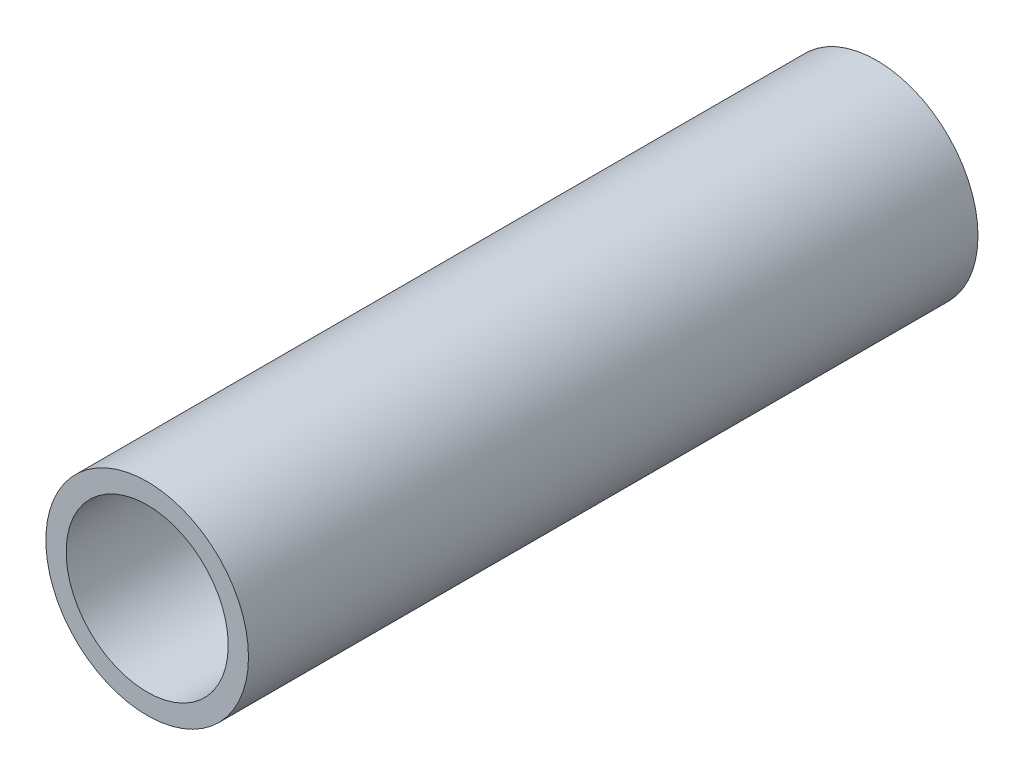
ISO-10303-21;
HEADER;
FILE_DESCRIPTION(('STEP AP214'),'2;1');
FILE_NAME('part.step','',(''),(''),'','','');
FILE_SCHEMA(('AUTOMOTIVE_DESIGN { 1 0 10303 214 1 1 1 1 }'));
ENDSEC;
DATA;
#1=APPLICATION_CONTEXT('core data for automotive mechanical design processes');
#2=APPLICATION_PROTOCOL_DEFINITION('international standard','automotive_design',2000,#1);
#3=PRODUCT_CONTEXT('',#1,'mechanical');
#4=PRODUCT('Part','Part','',(#3));
#5=PRODUCT_RELATED_PRODUCT_CATEGORY('part','',(#4));
#6=PRODUCT_DEFINITION_FORMATION('','',#4);
#7=PRODUCT_DEFINITION_CONTEXT('part definition',#1,'design');
#8=PRODUCT_DEFINITION('design','',#6,#7);
#9=PRODUCT_DEFINITION_SHAPE('','',#8);
#10=(LENGTH_UNIT() NAMED_UNIT(*) SI_UNIT(.MILLI.,.METRE.));
#11=(NAMED_UNIT(*) PLANE_ANGLE_UNIT() SI_UNIT($,.RADIAN.));
#12=(NAMED_UNIT(*) SI_UNIT($,.STERADIAN.) SOLID_ANGLE_UNIT());
#13=UNCERTAINTY_MEASURE_WITH_UNIT(LENGTH_MEASURE(1.E-05),#10,'distance_accuracy_value','');
#14=(GEOMETRIC_REPRESENTATION_CONTEXT(3) GLOBAL_UNCERTAINTY_ASSIGNED_CONTEXT((#13)) GLOBAL_UNIT_ASSIGNED_CONTEXT((#10,
#11,#12)) REPRESENTATION_CONTEXT('',''));
#15=CARTESIAN_POINT('',(0.,0.,0.));
#16=DIRECTION('',(0.,0.,1.));
#17=DIRECTION('',(1.,0.,0.));
#18=AXIS2_PLACEMENT_3D('',#15,#16,#17);
#19=CARTESIAN_POINT('',(0.,0.,9.));
#20=DIRECTION('',(0.,0.,1.));
#21=DIRECTION('',(1.,0.,0.));
#22=AXIS2_PLACEMENT_3D('',#19,#20,#21);
#23=PLANE('',#22);
#24=CARTESIAN_POINT('',(0.,0.,9.));
#25=DIRECTION('',(0.,0.,1.));
#26=DIRECTION('',(1.,0.,0.));
#27=AXIS2_PLACEMENT_3D('',#24,#25,#26);
#28=CIRCLE('',#27,1.25);
#29=CARTESIAN_POINT('',(1.25,0.,9.));
#30=VERTEX_POINT('',#29);
#31=EDGE_CURVE('E10',#30,#30,#28,.T.);
#32=ORIENTED_EDGE('',*,*,#31,.T.);
#33=EDGE_LOOP('',(#32));
#34=FACE_BOUND('',#33,.T.);
#35=CARTESIAN_POINT('',(0.,0.,9.));
#36=DIRECTION('',(0.,0.,1.));
#37=DIRECTION('',(1.,0.,0.));
#38=AXIS2_PLACEMENT_3D('',#35,#36,#37);
#39=CIRCLE('',#38,1.);
#40=CARTESIAN_POINT('',(1.,0.,9.));
#41=VERTEX_POINT('',#40);
#42=EDGE_CURVE('E42',#41,#41,#39,.T.);
#43=ORIENTED_EDGE('',*,*,#42,.F.);
#44=EDGE_LOOP('',(#43));
#45=FACE_BOUND('',#44,.T.);
#46=ADVANCED_FACE('F31',(#34,#45),#23,.T.);
#47=CARTESIAN_POINT('',(0.,0.,0.));
#48=DIRECTION('',(0.,0.,1.));
#49=DIRECTION('',(1.,0.,0.));
#50=AXIS2_PLACEMENT_3D('',#47,#48,#49);
#51=PLANE('',#50);
#52=CARTESIAN_POINT('',(0.,0.,0.));
#53=DIRECTION('',(0.,0.,1.));
#54=DIRECTION('',(1.,0.,0.));
#55=AXIS2_PLACEMENT_3D('',#52,#53,#54);
#56=CIRCLE('',#55,1.25);
#57=CARTESIAN_POINT('',(1.25,0.,0.));
#58=VERTEX_POINT('',#57);
#59=EDGE_CURVE('E35',#58,#58,#56,.T.);
#60=ORIENTED_EDGE('',*,*,#59,.F.);
#61=EDGE_LOOP('',(#60));
#62=FACE_BOUND('',#61,.T.);
#63=CARTESIAN_POINT('',(0.,0.,0.));
#64=DIRECTION('',(0.,0.,1.));
#65=DIRECTION('',(1.,0.,0.));
#66=AXIS2_PLACEMENT_3D('',#63,#64,#65);
#67=CIRCLE('',#66,1.);
#68=CARTESIAN_POINT('',(1.,0.,0.));
#69=VERTEX_POINT('',#68);
#70=EDGE_CURVE('E44',#69,#69,#67,.T.);
#71=ORIENTED_EDGE('',*,*,#70,.T.);
#72=EDGE_LOOP('',(#71));
#73=FACE_BOUND('',#72,.T.);
#74=ADVANCED_FACE('F54',(#62,#73),#51,.F.);
#75=CARTESIAN_POINT('',(0.,0.,9.));
#76=DIRECTION('',(0.,0.,-1.));
#77=DIRECTION('',(-1.,0.,0.));
#78=AXIS2_PLACEMENT_3D('',#75,#76,#77);
#79=CYLINDRICAL_SURFACE('',#78,1.25);
#80=ORIENTED_EDGE('',*,*,#31,.F.);
#81=EDGE_LOOP('',(#80));
#82=FACE_BOUND('',#81,.T.);
#83=ORIENTED_EDGE('',*,*,#59,.T.);
#84=EDGE_LOOP('',(#83));
#85=FACE_BOUND('',#84,.T.);
#86=ADVANCED_FACE('F33',(#82,#85),#79,.T.);
#87=CARTESIAN_POINT('',(0.,0.,9.));
#88=DIRECTION('',(0.,0.,-1.));
#89=DIRECTION('',(-1.,0.,0.));
#90=AXIS2_PLACEMENT_3D('',#87,#88,#89);
#91=CYLINDRICAL_SURFACE('',#90,1.);
#92=ORIENTED_EDGE('',*,*,#42,.T.);
#93=EDGE_LOOP('',(#92));
#94=FACE_BOUND('',#93,.T.);
#95=ORIENTED_EDGE('',*,*,#70,.F.);
#96=EDGE_LOOP('',(#95));
#97=FACE_BOUND('',#96,.T.);
#98=ADVANCED_FACE('F50',(#94,#97),#91,.F.);
#99=CLOSED_SHELL('',(#46,#74,#86,#98));
#100=MANIFOLD_SOLID_BREP('B2',#99);
#101=ADVANCED_BREP_SHAPE_REPRESENTATION('',(#18,#100),#14);
#102=SHAPE_DEFINITION_REPRESENTATION(#9,#101);
ENDSEC;
END-ISO-10303-21;
